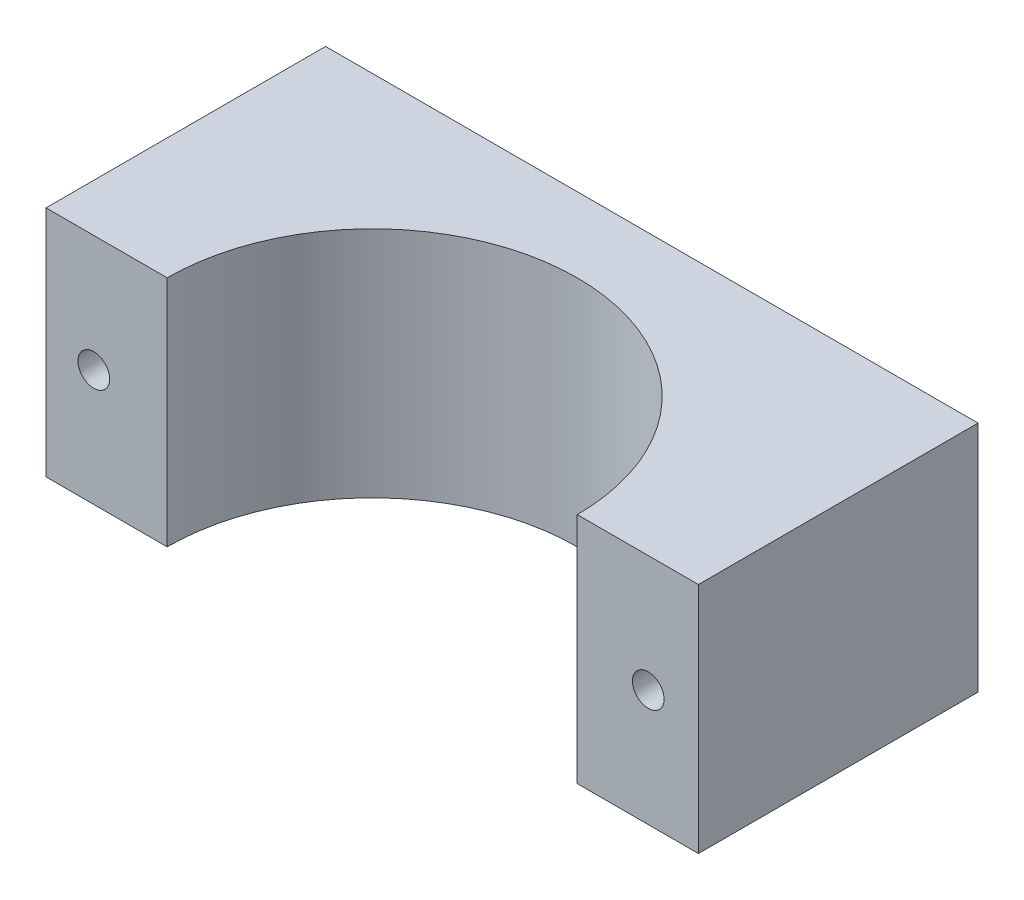
ISO-10303-21;
HEADER;
FILE_DESCRIPTION(('STEP AP214'),'2;1');
FILE_NAME('part.step','',(''),(''),'','','');
FILE_SCHEMA(('AUTOMOTIVE_DESIGN { 1 0 10303 214 1 1 1 1 }'));
ENDSEC;
DATA;
#1=APPLICATION_CONTEXT('core data for automotive mechanical design processes');
#2=APPLICATION_PROTOCOL_DEFINITION('international standard','automotive_design',2000,#1);
#3=PRODUCT_CONTEXT('',#1,'mechanical');
#4=PRODUCT('Part','Part','',(#3));
#5=PRODUCT_RELATED_PRODUCT_CATEGORY('part','',(#4));
#6=PRODUCT_DEFINITION_FORMATION('','',#4);
#7=PRODUCT_DEFINITION_CONTEXT('part definition',#1,'design');
#8=PRODUCT_DEFINITION('design','',#6,#7);
#9=PRODUCT_DEFINITION_SHAPE('','',#8);
#10=(LENGTH_UNIT() NAMED_UNIT(*) SI_UNIT(.MILLI.,.METRE.));
#11=(NAMED_UNIT(*) PLANE_ANGLE_UNIT() SI_UNIT($,.RADIAN.));
#12=(NAMED_UNIT(*) SI_UNIT($,.STERADIAN.) SOLID_ANGLE_UNIT());
#13=UNCERTAINTY_MEASURE_WITH_UNIT(LENGTH_MEASURE(1.E-05),#10,'distance_accuracy_value','');
#14=(GEOMETRIC_REPRESENTATION_CONTEXT(3) GLOBAL_UNCERTAINTY_ASSIGNED_CONTEXT((#13)) GLOBAL_UNIT_ASSIGNED_CONTEXT((#10,
#11,#12)) REPRESENTATION_CONTEXT('',''));
#15=CARTESIAN_POINT('',(0.,0.,0.));
#16=DIRECTION('',(0.,0.,1.));
#17=DIRECTION('',(1.,0.,0.));
#18=AXIS2_PLACEMENT_3D('',#15,#16,#17);
#19=CARTESIAN_POINT('',(5.45392076927602,25.,0.));
#20=DIRECTION('',(0.,-1.,0.));
#21=DIRECTION('',(0.,0.,-1.));
#22=AXIS2_PLACEMENT_3D('',#19,#20,#21);
#23=CYLINDRICAL_SURFACE('',#22,22.);
#24=CARTESIAN_POINT('',(5.45392076927602,0.,0.));
#25=DIRECTION('',(0.,1.,0.));
#26=DIRECTION('',(0.,0.,1.));
#27=AXIS2_PLACEMENT_3D('',#24,#25,#26);
#28=CIRCLE('',#27,22.);
#29=CARTESIAN_POINT('',(27.453920769276,0.,0.));
#30=VERTEX_POINT('',#29);
#31=CARTESIAN_POINT('',(-16.546079230724,0.,0.));
#32=VERTEX_POINT('',#31);
#33=EDGE_CURVE('E131',#30,#32,#28,.T.);
#34=ORIENTED_EDGE('',*,*,#33,.F.);
#35=DIRECTION('',(0.,-1.,0.));
#36=VECTOR('',#35,1.);
#37=CARTESIAN_POINT('',(27.453920769276,25.,0.));
#38=LINE('',#37,#36);
#39=CARTESIAN_POINT('',(27.453920769276,25.,0.));
#40=VERTEX_POINT('',#39);
#41=EDGE_CURVE('E11',#40,#30,#38,.T.);
#42=ORIENTED_EDGE('',*,*,#41,.F.);
#43=CARTESIAN_POINT('',(5.45392076927602,25.,0.));
#44=DIRECTION('',(0.,1.,0.));
#45=DIRECTION('',(0.,0.,1.));
#46=AXIS2_PLACEMENT_3D('',#43,#44,#45);
#47=CIRCLE('',#46,22.);
#48=CARTESIAN_POINT('',(-16.546079230724,25.,0.));
#49=VERTEX_POINT('',#48);
#50=EDGE_CURVE('E152',#40,#49,#47,.T.);
#51=ORIENTED_EDGE('',*,*,#50,.T.);
#52=DIRECTION('',(0.,-1.,0.));
#53=VECTOR('',#52,1.);
#54=CARTESIAN_POINT('',(-16.546079230724,25.,0.));
#55=LINE('',#54,#53);
#56=EDGE_CURVE('E90',#49,#32,#55,.T.);
#57=ORIENTED_EDGE('',*,*,#56,.T.);
#58=EDGE_LOOP('',(#34,#42,#51,#57));
#59=FACE_BOUND('',#58,.T.);
#60=ADVANCED_FACE('F45',(#59),#23,.F.);
#61=CARTESIAN_POINT('',(0.,25.,0.));
#62=DIRECTION('',(0.,0.,1.));
#63=DIRECTION('',(1.,0.,0.));
#64=AXIS2_PLACEMENT_3D('',#61,#62,#63);
#65=PLANE('',#64);
#66=CARTESIAN_POINT('',(35.073920769276,12.5,0.));
#67=DIRECTION('',(0.,0.,-1.));
#68=DIRECTION('',(-1.,0.,0.));
#69=AXIS2_PLACEMENT_3D('',#66,#67,#68);
#70=CIRCLE('',#69,1.7);
#71=CARTESIAN_POINT('',(33.373920769276,12.5,0.));
#72=VERTEX_POINT('',#71);
#73=EDGE_CURVE('E136',#72,#72,#70,.T.);
#74=ORIENTED_EDGE('',*,*,#73,.T.);
#75=EDGE_LOOP('',(#74));
#76=FACE_BOUND('',#75,.T.);
#77=DIRECTION('',(-1.,0.,0.));
#78=VECTOR('',#77,1.);
#79=CARTESIAN_POINT('',(0.,0.,0.));
#80=LINE('',#79,#78);
#81=CARTESIAN_POINT('',(40.453920769276,0.,0.));
#82=VERTEX_POINT('',#81);
#83=EDGE_CURVE('E135',#82,#30,#80,.T.);
#84=ORIENTED_EDGE('',*,*,#83,.F.);
#85=DIRECTION('',(0.,-1.,0.));
#86=VECTOR('',#85,1.);
#87=CARTESIAN_POINT('',(40.453920769276,25.,0.));
#88=LINE('',#87,#86);
#89=CARTESIAN_POINT('',(40.453920769276,25.,0.));
#90=VERTEX_POINT('',#89);
#91=EDGE_CURVE('E54',#90,#82,#88,.T.);
#92=ORIENTED_EDGE('',*,*,#91,.F.);
#93=DIRECTION('',(-1.,0.,0.));
#94=VECTOR('',#93,1.);
#95=CARTESIAN_POINT('',(0.,25.,0.));
#96=LINE('',#95,#94);
#97=EDGE_CURVE('E170',#90,#40,#96,.T.);
#98=ORIENTED_EDGE('',*,*,#97,.T.);
#99=ORIENTED_EDGE('',*,*,#41,.T.);
#100=EDGE_LOOP('',(#84,#92,#98,#99));
#101=FACE_BOUND('',#100,.T.);
#102=ADVANCED_FACE('F165',(#76,#101),#65,.T.);
#103=CARTESIAN_POINT('',(40.453920769276,25.,0.));
#104=DIRECTION('',(1.,0.,0.));
#105=DIRECTION('',(0.,0.,-1.));
#106=AXIS2_PLACEMENT_3D('',#103,#104,#105);
#107=PLANE('',#106);
#108=DIRECTION('',(0.,0.,1.));
#109=VECTOR('',#108,1.);
#110=CARTESIAN_POINT('',(40.453920769276,0.,0.));
#111=LINE('',#110,#109);
#112=CARTESIAN_POINT('',(40.453920769276,0.,-30.));
#113=VERTEX_POINT('',#112);
#114=EDGE_CURVE('E140',#113,#82,#111,.T.);
#115=ORIENTED_EDGE('',*,*,#114,.F.);
#116=DIRECTION('',(0.,-1.,0.));
#117=VECTOR('',#116,1.);
#118=CARTESIAN_POINT('',(40.453920769276,25.,-30.));
#119=LINE('',#118,#117);
#120=CARTESIAN_POINT('',(40.453920769276,25.,-30.));
#121=VERTEX_POINT('',#120);
#122=EDGE_CURVE('E114',#121,#113,#119,.T.);
#123=ORIENTED_EDGE('',*,*,#122,.F.);
#124=DIRECTION('',(0.,0.,1.));
#125=VECTOR('',#124,1.);
#126=CARTESIAN_POINT('',(40.453920769276,25.,0.));
#127=LINE('',#126,#125);
#128=EDGE_CURVE('E121',#121,#90,#127,.T.);
#129=ORIENTED_EDGE('',*,*,#128,.T.);
#130=ORIENTED_EDGE('',*,*,#91,.T.);
#131=EDGE_LOOP('',(#115,#123,#129,#130));
#132=FACE_BOUND('',#131,.T.);
#133=ADVANCED_FACE('F162',(#132),#107,.T.);
#134=CARTESIAN_POINT('',(0.,25.,-30.));
#135=DIRECTION('',(0.,0.,-1.));
#136=DIRECTION('',(-1.,0.,0.));
#137=AXIS2_PLACEMENT_3D('',#134,#135,#136);
#138=PLANE('',#137);
#139=CARTESIAN_POINT('',(35.073920769276,12.5,-30.));
#140=DIRECTION('',(0.,0.,-1.));
#141=DIRECTION('',(-1.,0.,0.));
#142=AXIS2_PLACEMENT_3D('',#139,#140,#141);
#143=CIRCLE('',#142,1.7);
#144=CARTESIAN_POINT('',(33.373920769276,12.5,-30.));
#145=VERTEX_POINT('',#144);
#146=EDGE_CURVE('E184',#145,#145,#143,.T.);
#147=ORIENTED_EDGE('',*,*,#146,.F.);
#148=EDGE_LOOP('',(#147));
#149=FACE_BOUND('',#148,.T.);
#150=CARTESIAN_POINT('',(-24.416079230724,12.5,-30.));
#151=DIRECTION('',(0.,0.,-1.));
#152=DIRECTION('',(-1.,0.,0.));
#153=AXIS2_PLACEMENT_3D('',#150,#151,#152);
#154=CIRCLE('',#153,1.7);
#155=CARTESIAN_POINT('',(-26.116079230724,12.5,-30.));
#156=VERTEX_POINT('',#155);
#157=EDGE_CURVE('E175',#156,#156,#154,.T.);
#158=ORIENTED_EDGE('',*,*,#157,.F.);
#159=EDGE_LOOP('',(#158));
#160=FACE_BOUND('',#159,.T.);
#161=DIRECTION('',(1.,0.,0.));
#162=VECTOR('',#161,1.);
#163=CARTESIAN_POINT('',(0.,0.,-30.));
#164=LINE('',#163,#162);
#165=CARTESIAN_POINT('',(-29.546079230724,0.,-30.));
#166=VERTEX_POINT('',#165);
#167=EDGE_CURVE('E108',#166,#113,#164,.T.);
#168=ORIENTED_EDGE('',*,*,#167,.F.);
#169=DIRECTION('',(0.,-1.,0.));
#170=VECTOR('',#169,1.);
#171=CARTESIAN_POINT('',(-29.546079230724,25.,-30.));
#172=LINE('',#171,#170);
#173=CARTESIAN_POINT('',(-29.546079230724,25.,-30.));
#174=VERTEX_POINT('',#173);
#175=EDGE_CURVE('E103',#174,#166,#172,.T.);
#176=ORIENTED_EDGE('',*,*,#175,.F.);
#177=DIRECTION('',(1.,0.,0.));
#178=VECTOR('',#177,1.);
#179=CARTESIAN_POINT('',(0.,25.,-30.));
#180=LINE('',#179,#178);
#181=EDGE_CURVE('E106',#174,#121,#180,.T.);
#182=ORIENTED_EDGE('',*,*,#181,.T.);
#183=ORIENTED_EDGE('',*,*,#122,.T.);
#184=EDGE_LOOP('',(#168,#176,#182,#183));
#185=FACE_BOUND('',#184,.T.);
#186=ADVANCED_FACE('F105',(#149,#160,#185),#138,.T.);
#187=CARTESIAN_POINT('',(-29.546079230724,25.,0.));
#188=DIRECTION('',(-1.,0.,0.));
#189=DIRECTION('',(0.,0.,1.));
#190=AXIS2_PLACEMENT_3D('',#187,#188,#189);
#191=PLANE('',#190);
#192=DIRECTION('',(0.,0.,-1.));
#193=VECTOR('',#192,1.);
#194=CARTESIAN_POINT('',(-29.546079230724,0.,0.));
#195=LINE('',#194,#193);
#196=CARTESIAN_POINT('',(-29.546079230724,0.,0.));
#197=VERTEX_POINT('',#196);
#198=EDGE_CURVE('E146',#197,#166,#195,.T.);
#199=ORIENTED_EDGE('',*,*,#198,.F.);
#200=DIRECTION('',(0.,-1.,0.));
#201=VECTOR('',#200,1.);
#202=CARTESIAN_POINT('',(-29.546079230724,25.,0.));
#203=LINE('',#202,#201);
#204=CARTESIAN_POINT('',(-29.546079230724,25.,0.));
#205=VERTEX_POINT('',#204);
#206=EDGE_CURVE('E83',#205,#197,#203,.T.);
#207=ORIENTED_EDGE('',*,*,#206,.F.);
#208=DIRECTION('',(0.,0.,-1.));
#209=VECTOR('',#208,1.);
#210=CARTESIAN_POINT('',(-29.546079230724,25.,0.));
#211=LINE('',#210,#209);
#212=EDGE_CURVE('E118',#205,#174,#211,.T.);
#213=ORIENTED_EDGE('',*,*,#212,.T.);
#214=ORIENTED_EDGE('',*,*,#175,.T.);
#215=EDGE_LOOP('',(#199,#207,#213,#214));
#216=FACE_BOUND('',#215,.T.);
#217=ADVANCED_FACE('F124',(#216),#191,.T.);
#218=CARTESIAN_POINT('',(0.,25.,0.));
#219=DIRECTION('',(0.,0.,-1.));
#220=DIRECTION('',(-1.,0.,0.));
#221=AXIS2_PLACEMENT_3D('',#218,#219,#220);
#222=PLANE('',#221);
#223=CARTESIAN_POINT('',(-24.416079230724,12.5,0.));
#224=DIRECTION('',(0.,0.,-1.));
#225=DIRECTION('',(-1.,0.,0.));
#226=AXIS2_PLACEMENT_3D('',#223,#224,#225);
#227=CIRCLE('',#226,1.7);
#228=CARTESIAN_POINT('',(-26.116079230724,12.5,0.));
#229=VERTEX_POINT('',#228);
#230=EDGE_CURVE('E180',#229,#229,#227,.T.);
#231=ORIENTED_EDGE('',*,*,#230,.T.);
#232=EDGE_LOOP('',(#231));
#233=FACE_BOUND('',#232,.T.);
#234=DIRECTION('',(1.,0.,0.));
#235=VECTOR('',#234,1.);
#236=CARTESIAN_POINT('',(0.,0.,0.));
#237=LINE('',#236,#235);
#238=EDGE_CURVE('E149',#197,#32,#237,.T.);
#239=ORIENTED_EDGE('',*,*,#238,.T.);
#240=ORIENTED_EDGE('',*,*,#56,.F.);
#241=DIRECTION('',(1.,0.,0.));
#242=VECTOR('',#241,1.);
#243=CARTESIAN_POINT('',(0.,25.,0.));
#244=LINE('',#243,#242);
#245=EDGE_CURVE('E62',#205,#49,#244,.T.);
#246=ORIENTED_EDGE('',*,*,#245,.F.);
#247=ORIENTED_EDGE('',*,*,#206,.T.);
#248=EDGE_LOOP('',(#239,#240,#246,#247));
#249=FACE_BOUND('',#248,.T.);
#250=ADVANCED_FACE('F168',(#233,#249),#222,.F.);
#251=CARTESIAN_POINT('',(0.,25.,0.));
#252=DIRECTION('',(0.,1.,0.));
#253=DIRECTION('',(0.,0.,1.));
#254=AXIS2_PLACEMENT_3D('',#251,#252,#253);
#255=PLANE('',#254);
#256=ORIENTED_EDGE('',*,*,#50,.F.);
#257=ORIENTED_EDGE('',*,*,#97,.F.);
#258=ORIENTED_EDGE('',*,*,#128,.F.);
#259=ORIENTED_EDGE('',*,*,#181,.F.);
#260=ORIENTED_EDGE('',*,*,#212,.F.);
#261=ORIENTED_EDGE('',*,*,#245,.T.);
#262=EDGE_LOOP('',(#256,#257,#258,#259,#260,#261));
#263=FACE_BOUND('',#262,.T.);
#264=ADVANCED_FACE('F117',(#263),#255,.T.);
#265=CARTESIAN_POINT('',(0.,0.,0.));
#266=DIRECTION('',(0.,1.,0.));
#267=DIRECTION('',(0.,0.,1.));
#268=AXIS2_PLACEMENT_3D('',#265,#266,#267);
#269=PLANE('',#268);
#270=ORIENTED_EDGE('',*,*,#33,.T.);
#271=ORIENTED_EDGE('',*,*,#238,.F.);
#272=ORIENTED_EDGE('',*,*,#198,.T.);
#273=ORIENTED_EDGE('',*,*,#167,.T.);
#274=ORIENTED_EDGE('',*,*,#114,.T.);
#275=ORIENTED_EDGE('',*,*,#83,.T.);
#276=EDGE_LOOP('',(#270,#271,#272,#273,#274,#275));
#277=FACE_BOUND('',#276,.T.);
#278=ADVANCED_FACE('F167',(#277),#269,.F.);
#279=CARTESIAN_POINT('',(-24.416079230724,12.5,0.));
#280=DIRECTION('',(0.,0.,-1.));
#281=DIRECTION('',(-1.,0.,0.));
#282=AXIS2_PLACEMENT_3D('',#279,#280,#281);
#283=CYLINDRICAL_SURFACE('',#282,1.7);
#284=ORIENTED_EDGE('',*,*,#230,.F.);
#285=EDGE_LOOP('',(#284));
#286=FACE_BOUND('',#285,.T.);
#287=ORIENTED_EDGE('',*,*,#157,.T.);
#288=EDGE_LOOP('',(#287));
#289=FACE_BOUND('',#288,.T.);
#290=ADVANCED_FACE('F196',(#286,#289),#283,.F.);
#291=CARTESIAN_POINT('',(35.073920769276,12.5,0.));
#292=DIRECTION('',(0.,0.,-1.));
#293=DIRECTION('',(-1.,0.,0.));
#294=AXIS2_PLACEMENT_3D('',#291,#292,#293);
#295=CYLINDRICAL_SURFACE('',#294,1.7);
#296=ORIENTED_EDGE('',*,*,#73,.F.);
#297=EDGE_LOOP('',(#296));
#298=FACE_BOUND('',#297,.T.);
#299=ORIENTED_EDGE('',*,*,#146,.T.);
#300=EDGE_LOOP('',(#299));
#301=FACE_BOUND('',#300,.T.);
#302=ADVANCED_FACE('F193',(#298,#301),#295,.F.);
#303=CLOSED_SHELL('',(#60,#102,#133,#186,#217,#250,#264,#278,#290,#302));
#304=MANIFOLD_SOLID_BREP('B2',#303);
#305=ADVANCED_BREP_SHAPE_REPRESENTATION('',(#18,#304),#14);
#306=SHAPE_DEFINITION_REPRESENTATION(#9,#305);
ENDSEC;
END-ISO-10303-21;
